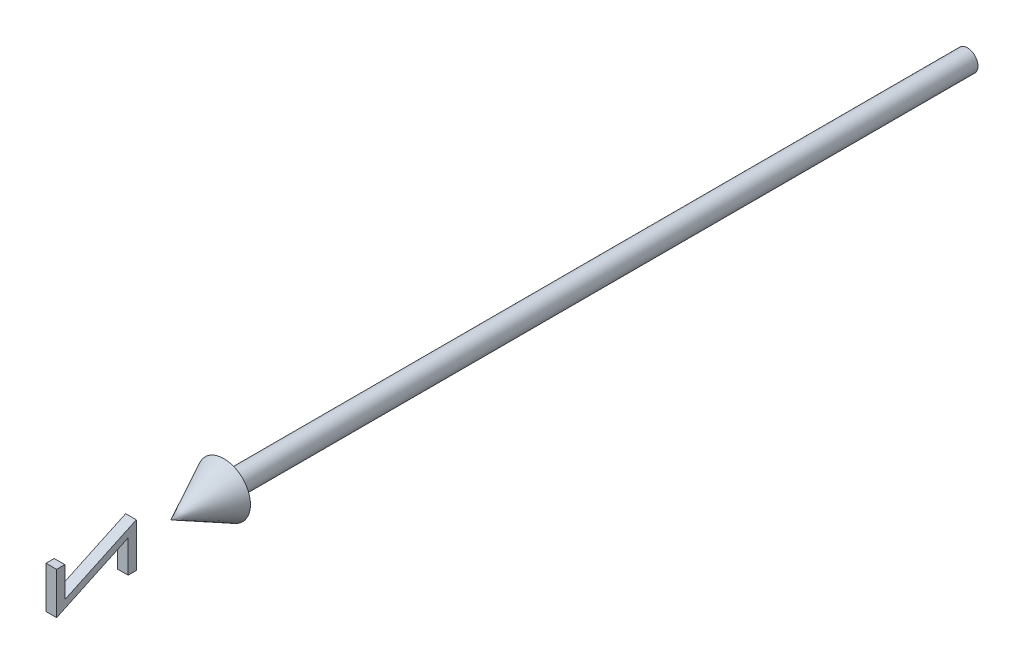
ISO-10303-21;
HEADER;
FILE_DESCRIPTION(('STEP AP214'),'2;1');
FILE_NAME('part.step','',(''),(''),'','','');
FILE_SCHEMA(('AUTOMOTIVE_DESIGN { 1 0 10303 214 1 1 1 1 }'));
ENDSEC;
DATA;
#1=APPLICATION_CONTEXT('core data for automotive mechanical design processes');
#2=APPLICATION_PROTOCOL_DEFINITION('international standard','automotive_design',2000,#1);
#3=PRODUCT_CONTEXT('',#1,'mechanical');
#4=PRODUCT('Part','Part','',(#3));
#5=PRODUCT_RELATED_PRODUCT_CATEGORY('part','',(#4));
#6=PRODUCT_DEFINITION_FORMATION('','',#4);
#7=PRODUCT_DEFINITION_CONTEXT('part definition',#1,'design');
#8=PRODUCT_DEFINITION('design','',#6,#7);
#9=PRODUCT_DEFINITION_SHAPE('','',#8);
#10=(LENGTH_UNIT() NAMED_UNIT(*) SI_UNIT(.MILLI.,.METRE.));
#11=(NAMED_UNIT(*) PLANE_ANGLE_UNIT() SI_UNIT($,.RADIAN.));
#12=(NAMED_UNIT(*) SI_UNIT($,.STERADIAN.) SOLID_ANGLE_UNIT());
#13=UNCERTAINTY_MEASURE_WITH_UNIT(LENGTH_MEASURE(1.E-05),#10,'distance_accuracy_value','');
#14=(GEOMETRIC_REPRESENTATION_CONTEXT(3) GLOBAL_UNCERTAINTY_ASSIGNED_CONTEXT((#13)) GLOBAL_UNIT_ASSIGNED_CONTEXT((#10,
#11,#12)) REPRESENTATION_CONTEXT('',''));
#15=CARTESIAN_POINT('',(0.,0.,0.));
#16=DIRECTION('',(0.,0.,1.));
#17=DIRECTION('',(1.,0.,0.));
#18=AXIS2_PLACEMENT_3D('',#15,#16,#17);
#19=CARTESIAN_POINT('',(1.00000000000009,-2.02042429202079,170.961538461538));
#20=DIRECTION('',(0.,0.,1.));
#21=DIRECTION('',(1.,0.,0.));
#22=AXIS2_PLACEMENT_3D('',#19,#20,#21);
#23=PLANE('',#22);
#24=DIRECTION('',(-1.,0.,0.));
#25=VECTOR('',#24,1.);
#26=CARTESIAN_POINT('',(1.00000000000009,-2.02042429202079,170.961538461538));
#27=LINE('',#26,#25);
#28=CARTESIAN_POINT('',(1.00000000000009,-2.02042429202079,170.961538461538));
#29=VERTEX_POINT('',#28);
#30=CARTESIAN_POINT('',(-0.999999999999906,-2.02042429202079,170.961538461538));
#31=VERTEX_POINT('',#30);
#32=EDGE_CURVE('E131',#29,#31,#27,.T.);
#33=ORIENTED_EDGE('',*,*,#32,.T.);
#34=DIRECTION('',(0.,1.,0.));
#35=VECTOR('',#34,1.);
#36=CARTESIAN_POINT('',(-0.999999999999906,-2.02042429202079,170.961538461538));
#37=LINE('',#36,#35);
#38=CARTESIAN_POINT('',(-0.999999999999906,3.69471993874844,170.961538461538));
#39=VERTEX_POINT('',#38);
#40=EDGE_CURVE('E125',#31,#39,#37,.T.);
#41=ORIENTED_EDGE('',*,*,#40,.T.);
#42=DIRECTION('',(-1.,0.,0.));
#43=VECTOR('',#42,1.);
#44=CARTESIAN_POINT('',(1.00000000000009,3.69471993874844,170.961538461538));
#45=LINE('',#44,#43);
#46=CARTESIAN_POINT('',(1.00000000000009,3.69471993874844,170.961538461538));
#47=VERTEX_POINT('',#46);
#48=EDGE_CURVE('E12',#47,#39,#45,.T.);
#49=ORIENTED_EDGE('',*,*,#48,.F.);
#50=DIRECTION('',(0.,1.,0.));
#51=VECTOR('',#50,1.);
#52=CARTESIAN_POINT('',(1.00000000000009,-2.02042429202079,170.961538461538));
#53=LINE('',#52,#51);
#54=EDGE_CURVE('E149',#29,#47,#53,.T.);
#55=ORIENTED_EDGE('',*,*,#54,.F.);
#56=EDGE_LOOP('',(#33,#41,#49,#55));
#57=FACE_BOUND('',#56,.T.);
#58=ADVANCED_FACE('F49',(#57),#23,.F.);
#59=CARTESIAN_POINT('',(1.00000000000009,3.69471993874844,170.961538461538));
#60=DIRECTION('',(0.,-1.,0.));
#61=DIRECTION('',(0.,0.,-1.));
#62=AXIS2_PLACEMENT_3D('',#59,#60,#61);
#63=PLANE('',#62);
#64=ORIENTED_EDGE('',*,*,#48,.T.);
#65=DIRECTION('',(0.,0.,1.));
#66=VECTOR('',#65,1.);
#67=CARTESIAN_POINT('',(-0.999999999999906,3.69471993874844,170.961538461538));
#68=LINE('',#67,#66);
#69=CARTESIAN_POINT('',(-0.999999999999895,3.69471993874844,172.5));
#70=VERTEX_POINT('',#69);
#71=EDGE_CURVE('E115',#39,#70,#68,.T.);
#72=ORIENTED_EDGE('',*,*,#71,.T.);
#73=DIRECTION('',(-1.,0.,0.));
#74=VECTOR('',#73,1.);
#75=CARTESIAN_POINT('',(1.0000000000001,3.69471993874844,172.5));
#76=LINE('',#75,#74);
#77=CARTESIAN_POINT('',(1.0000000000001,3.69471993874844,172.5));
#78=VERTEX_POINT('',#77);
#79=EDGE_CURVE('E56',#78,#70,#76,.T.);
#80=ORIENTED_EDGE('',*,*,#79,.F.);
#81=DIRECTION('',(0.,0.,1.));
#82=VECTOR('',#81,1.);
#83=CARTESIAN_POINT('',(1.00000000000009,3.69471993874844,170.961538461538));
#84=LINE('',#83,#82);
#85=EDGE_CURVE('E116',#47,#78,#84,.T.);
#86=ORIENTED_EDGE('',*,*,#85,.F.);
#87=EDGE_LOOP('',(#64,#72,#80,#86));
#88=FACE_BOUND('',#87,.T.);
#89=ADVANCED_FACE('F113',(#88),#63,.F.);
#90=CARTESIAN_POINT('',(1.0000000000001,3.69471993874844,172.5));
#91=DIRECTION('',(0.,0.,-1.));
#92=DIRECTION('',(-1.,0.,0.));
#93=AXIS2_PLACEMENT_3D('',#90,#91,#92);
#94=PLANE('',#93);
#95=ORIENTED_EDGE('',*,*,#79,.T.);
#96=DIRECTION('',(0.,-1.,0.));
#97=VECTOR('',#96,1.);
#98=CARTESIAN_POINT('',(-0.999999999999895,3.69471993874844,172.5));
#99=LINE('',#98,#97);
#100=CARTESIAN_POINT('',(-0.999999999999895,-4.18989544586694,172.5));
#101=VERTEX_POINT('',#100);
#102=EDGE_CURVE('E129',#70,#101,#99,.T.);
#103=ORIENTED_EDGE('',*,*,#102,.T.);
#104=DIRECTION('',(-1.,0.,0.));
#105=VECTOR('',#104,1.);
#106=CARTESIAN_POINT('',(1.0000000000001,-4.18989544586694,172.5));
#107=LINE('',#106,#105);
#108=CARTESIAN_POINT('',(1.0000000000001,-4.18989544586694,172.5));
#109=VERTEX_POINT('',#108);
#110=EDGE_CURVE('E171',#109,#101,#107,.T.);
#111=ORIENTED_EDGE('',*,*,#110,.F.);
#112=DIRECTION('',(0.,-1.,0.));
#113=VECTOR('',#112,1.);
#114=CARTESIAN_POINT('',(1.0000000000001,3.69471993874844,172.5));
#115=LINE('',#114,#113);
#116=EDGE_CURVE('E152',#78,#109,#115,.T.);
#117=ORIENTED_EDGE('',*,*,#116,.F.);
#118=EDGE_LOOP('',(#95,#103,#111,#117));
#119=FACE_BOUND('',#118,.T.);
#120=ADVANCED_FACE('F174',(#119),#94,.F.);
#121=CARTESIAN_POINT('',(1.0000000000001,-4.18989544586694,172.5));
#122=DIRECTION('',(0.,0.905924666699453,0.42343889555104));
#123=DIRECTION('',(0.,-0.42343889555104,0.905924666699453));
#124=AXIS2_PLACEMENT_3D('',#121,#122,#123);
#125=PLANE('',#124);
#126=ORIENTED_EDGE('',*,*,#110,.T.);
#127=DIRECTION('',(0.,0.42343889555104,-0.905924666699453));
#128=VECTOR('',#127,1.);
#129=CARTESIAN_POINT('',(-0.999999999999895,-4.18989544586694,172.5));
#130=LINE('',#129,#128);
#131=CARTESIAN_POINT('',(-0.999999999999989,2.10217186182537,159.038461538462));
#132=VERTEX_POINT('',#131);
#133=EDGE_CURVE('E135',#101,#132,#130,.T.);
#134=ORIENTED_EDGE('',*,*,#133,.T.);
#135=DIRECTION('',(-1.,0.,0.));
#136=VECTOR('',#135,1.);
#137=CARTESIAN_POINT('',(1.00000000000001,2.10217186182537,159.038461538462));
#138=LINE('',#137,#136);
#139=CARTESIAN_POINT('',(1.00000000000001,2.10217186182537,159.038461538462));
#140=VERTEX_POINT('',#139);
#141=EDGE_CURVE('E169',#140,#132,#138,.T.);
#142=ORIENTED_EDGE('',*,*,#141,.F.);
#143=DIRECTION('',(0.,0.42343889555104,-0.905924666699453));
#144=VECTOR('',#143,1.);
#145=CARTESIAN_POINT('',(1.0000000000001,-4.18989544586694,172.5));
#146=LINE('',#145,#144);
#147=EDGE_CURVE('E154',#109,#140,#146,.T.);
#148=ORIENTED_EDGE('',*,*,#147,.F.);
#149=EDGE_LOOP('',(#126,#134,#142,#148));
#150=FACE_BOUND('',#149,.T.);
#151=ADVANCED_FACE('F182',(#150),#125,.F.);
#152=CARTESIAN_POINT('',(1.00000000000001,2.10217186182537,159.038461538462));
#153=DIRECTION('',(0.,0.,-1.));
#154=DIRECTION('',(-1.,0.,0.));
#155=AXIS2_PLACEMENT_3D('',#152,#153,#154);
#156=PLANE('',#155);
#157=ORIENTED_EDGE('',*,*,#141,.T.);
#158=DIRECTION('',(0.,-1.,0.));
#159=VECTOR('',#158,1.);
#160=CARTESIAN_POINT('',(-0.999999999999989,2.10217186182537,159.038461538462));
#161=LINE('',#160,#159);
#162=CARTESIAN_POINT('',(-0.999999999999989,-3.99758775355925,159.038461538462));
#163=VERTEX_POINT('',#162);
#164=EDGE_CURVE('E138',#132,#163,#161,.T.);
#165=ORIENTED_EDGE('',*,*,#164,.T.);
#166=DIRECTION('',(-1.,0.,0.));
#167=VECTOR('',#166,1.);
#168=CARTESIAN_POINT('',(1.00000000000001,-3.99758775355925,159.038461538462));
#169=LINE('',#168,#167);
#170=CARTESIAN_POINT('',(1.00000000000001,-3.99758775355925,159.038461538462));
#171=VERTEX_POINT('',#170);
#172=EDGE_CURVE('E167',#171,#163,#169,.T.);
#173=ORIENTED_EDGE('',*,*,#172,.F.);
#174=DIRECTION('',(0.,-1.,0.));
#175=VECTOR('',#174,1.);
#176=CARTESIAN_POINT('',(1.00000000000001,2.10217186182537,159.038461538462));
#177=LINE('',#176,#175);
#178=EDGE_CURVE('E156',#140,#171,#177,.T.);
#179=ORIENTED_EDGE('',*,*,#178,.F.);
#180=EDGE_LOOP('',(#157,#165,#173,#179));
#181=FACE_BOUND('',#180,.T.);
#182=ADVANCED_FACE('F185',(#181),#156,.F.);
#183=CARTESIAN_POINT('',(1.00000000000001,-3.99758775355925,159.038461538462));
#184=DIRECTION('',(0.,1.,0.));
#185=DIRECTION('',(0.,0.,1.));
#186=AXIS2_PLACEMENT_3D('',#183,#184,#185);
#187=PLANE('',#186);
#188=ORIENTED_EDGE('',*,*,#172,.T.);
#189=DIRECTION('',(0.,0.,-1.));
#190=VECTOR('',#189,1.);
#191=CARTESIAN_POINT('',(-0.999999999999989,-3.99758775355925,159.038461538462));
#192=LINE('',#191,#190);
#193=CARTESIAN_POINT('',(-1.,-3.99758775355925,157.5));
#194=VERTEX_POINT('',#193);
#195=EDGE_CURVE('E141',#163,#194,#192,.T.);
#196=ORIENTED_EDGE('',*,*,#195,.T.);
#197=DIRECTION('',(-1.,0.,0.));
#198=VECTOR('',#197,1.);
#199=CARTESIAN_POINT('',(1.,-3.99758775355925,157.5));
#200=LINE('',#199,#198);
#201=CARTESIAN_POINT('',(1.,-3.99758775355925,157.5));
#202=VERTEX_POINT('',#201);
#203=EDGE_CURVE('E165',#202,#194,#200,.T.);
#204=ORIENTED_EDGE('',*,*,#203,.F.);
#205=DIRECTION('',(0.,0.,-1.));
#206=VECTOR('',#205,1.);
#207=CARTESIAN_POINT('',(1.00000000000001,-3.99758775355925,159.038461538462));
#208=LINE('',#207,#206);
#209=EDGE_CURVE('E158',#171,#202,#208,.T.);
#210=ORIENTED_EDGE('',*,*,#209,.F.);
#211=EDGE_LOOP('',(#188,#196,#204,#210));
#212=FACE_BOUND('',#211,.T.);
#213=ADVANCED_FACE('F190',(#212),#187,.F.);
#214=CARTESIAN_POINT('',(1.,-3.99758775355925,157.5));
#215=DIRECTION('',(0.,0.,1.));
#216=DIRECTION('',(1.,0.,0.));
#217=AXIS2_PLACEMENT_3D('',#214,#215,#216);
#218=PLANE('',#217);
#219=ORIENTED_EDGE('',*,*,#203,.T.);
#220=DIRECTION('',(0.,1.,0.));
#221=VECTOR('',#220,1.);
#222=CARTESIAN_POINT('',(-1.,-3.99758775355925,157.5));
#223=LINE('',#222,#221);
#224=CARTESIAN_POINT('',(-1.,4.27164301567152,157.5));
#225=VERTEX_POINT('',#224);
#226=EDGE_CURVE('E144',#194,#225,#223,.T.);
#227=ORIENTED_EDGE('',*,*,#226,.T.);
#228=DIRECTION('',(-1.,0.,0.));
#229=VECTOR('',#228,1.);
#230=CARTESIAN_POINT('',(1.,4.27164301567152,157.5));
#231=LINE('',#230,#229);
#232=CARTESIAN_POINT('',(1.,4.27164301567152,157.5));
#233=VERTEX_POINT('',#232);
#234=EDGE_CURVE('E163',#233,#225,#231,.T.);
#235=ORIENTED_EDGE('',*,*,#234,.F.);
#236=DIRECTION('',(0.,1.,0.));
#237=VECTOR('',#236,1.);
#238=CARTESIAN_POINT('',(1.,-3.99758775355925,157.5));
#239=LINE('',#238,#237);
#240=EDGE_CURVE('E68',#202,#233,#239,.T.);
#241=ORIENTED_EDGE('',*,*,#240,.F.);
#242=EDGE_LOOP('',(#219,#227,#235,#241));
#243=FACE_BOUND('',#242,.T.);
#244=ADVANCED_FACE('F193',(#243),#218,.F.);
#245=CARTESIAN_POINT('',(1.,4.27164301567152,157.5));
#246=DIRECTION('',(0.,-0.905924666699454,-0.423438895551039));
#247=DIRECTION('',(0.,0.423438895551039,-0.905924666699454));
#248=AXIS2_PLACEMENT_3D('',#245,#246,#247);
#249=PLANE('',#248);
#250=ORIENTED_EDGE('',*,*,#234,.T.);
#251=DIRECTION('',(0.,-0.423438895551039,0.905924666699454));
#252=VECTOR('',#251,1.);
#253=CARTESIAN_POINT('',(-1.,4.27164301567152,157.5));
#254=LINE('',#253,#252);
#255=EDGE_CURVE('E147',#225,#31,#254,.T.);
#256=ORIENTED_EDGE('',*,*,#255,.T.);
#257=ORIENTED_EDGE('',*,*,#32,.F.);
#258=DIRECTION('',(0.,-0.423438895551039,0.905924666699454));
#259=VECTOR('',#258,1.);
#260=CARTESIAN_POINT('',(1.,4.27164301567152,157.5));
#261=LINE('',#260,#259);
#262=EDGE_CURVE('E63',#233,#29,#261,.T.);
#263=ORIENTED_EDGE('',*,*,#262,.F.);
#264=EDGE_LOOP('',(#250,#256,#257,#263));
#265=FACE_BOUND('',#264,.T.);
#266=ADVANCED_FACE('F195',(#265),#249,.F.);
#267=CARTESIAN_POINT('',(0.9999999999989,0.,0.));
#268=DIRECTION('',(1.,0.,0.));
#269=DIRECTION('',(0.,0.,-1.));
#270=AXIS2_PLACEMENT_3D('',#267,#268,#269);
#271=PLANE('',#270);
#272=ORIENTED_EDGE('',*,*,#54,.T.);
#273=ORIENTED_EDGE('',*,*,#85,.T.);
#274=ORIENTED_EDGE('',*,*,#116,.T.);
#275=ORIENTED_EDGE('',*,*,#147,.T.);
#276=ORIENTED_EDGE('',*,*,#178,.T.);
#277=ORIENTED_EDGE('',*,*,#209,.T.);
#278=ORIENTED_EDGE('',*,*,#240,.T.);
#279=ORIENTED_EDGE('',*,*,#262,.T.);
#280=EDGE_LOOP('',(#272,#273,#274,#275,#276,#277,#278,#279));
#281=FACE_BOUND('',#280,.T.);
#282=ADVANCED_FACE('F177',(#281),#271,.T.);
#283=CARTESIAN_POINT('',(-1.0000000000011,0.,0.));
#284=DIRECTION('',(1.,0.,0.));
#285=DIRECTION('',(0.,0.,-1.));
#286=AXIS2_PLACEMENT_3D('',#283,#284,#285);
#287=PLANE('',#286);
#288=ORIENTED_EDGE('',*,*,#40,.F.);
#289=ORIENTED_EDGE('',*,*,#255,.F.);
#290=ORIENTED_EDGE('',*,*,#226,.F.);
#291=ORIENTED_EDGE('',*,*,#195,.F.);
#292=ORIENTED_EDGE('',*,*,#164,.F.);
#293=ORIENTED_EDGE('',*,*,#133,.F.);
#294=ORIENTED_EDGE('',*,*,#102,.F.);
#295=ORIENTED_EDGE('',*,*,#71,.F.);
#296=EDGE_LOOP('',(#288,#289,#290,#291,#292,#293,#294,#295));
#297=FACE_BOUND('',#296,.T.);
#298=ADVANCED_FACE('F123',(#297),#287,.F.);
#299=CLOSED_SHELL('',(#58,#89,#120,#151,#182,#213,#244,#266,#282,#298));
#300=MANIFOLD_SOLID_BREP('B2',#299);
#301=CARTESIAN_POINT('',(2.,0.,0.));
#302=DIRECTION('',(0.,0.,1.));
#303=DIRECTION('',(1.,0.,0.));
#304=AXIS2_PLACEMENT_3D('',#301,#302,#303);
#305=PLANE('',#304);
#306=CARTESIAN_POINT('',(0.,0.,0.));
#307=DIRECTION('',(0.,0.,-1.));
#308=DIRECTION('',(-1.,0.,0.));
#309=AXIS2_PLACEMENT_3D('',#306,#307,#308);
#310=CIRCLE('',#309,2.);
#311=CARTESIAN_POINT('',(-2.,0.,0.));
#312=VERTEX_POINT('',#311);
#313=EDGE_CURVE('E47',#312,#312,#310,.T.);
#314=ORIENTED_EDGE('',*,*,#313,.T.);
#315=EDGE_LOOP('',(#314));
#316=FACE_BOUND('',#315,.T.);
#317=ADVANCED_FACE('F277',(#316),#305,.F.);
#318=CARTESIAN_POINT('',(0.,0.,-41.9499520246458));
#319=DIRECTION('',(0.,0.,-1.));
#320=DIRECTION('',(-1.,0.,0.));
#321=AXIS2_PLACEMENT_3D('',#318,#319,#320);
#322=CYLINDRICAL_SURFACE('',#321,2.);
#323=ORIENTED_EDGE('',*,*,#313,.F.);
#324=EDGE_LOOP('',(#323));
#325=FACE_BOUND('',#324,.T.);
#326=CARTESIAN_POINT('',(0.,0.,140.));
#327=DIRECTION('',(0.,0.,-1.));
#328=DIRECTION('',(-1.,0.,0.));
#329=AXIS2_PLACEMENT_3D('',#326,#327,#328);
#330=CIRCLE('',#329,2.);
#331=CARTESIAN_POINT('',(-2.,0.,140.));
#332=VERTEX_POINT('',#331);
#333=EDGE_CURVE('E283',#332,#332,#330,.T.);
#334=ORIENTED_EDGE('',*,*,#333,.T.);
#335=EDGE_LOOP('',(#334));
#336=FACE_BOUND('',#335,.T.);
#337=ADVANCED_FACE('F294',(#325,#336),#322,.T.);
#338=CARTESIAN_POINT('',(5.00000000000002,0.,140.));
#339=DIRECTION('',(0.,0.,1.));
#340=DIRECTION('',(1.,0.,0.));
#341=AXIS2_PLACEMENT_3D('',#338,#339,#340);
#342=PLANE('',#341);
#343=ORIENTED_EDGE('',*,*,#333,.F.);
#344=EDGE_LOOP('',(#343));
#345=FACE_BOUND('',#344,.T.);
#346=CARTESIAN_POINT('',(0.,0.,140.));
#347=DIRECTION('',(0.,0.,-1.));
#348=DIRECTION('',(-1.,0.,0.));
#349=AXIS2_PLACEMENT_3D('',#346,#347,#348);
#350=CIRCLE('',#349,5.00000000000002);
#351=CARTESIAN_POINT('',(-5.00000000000002,0.,140.));
#352=VERTEX_POINT('',#351);
#353=EDGE_CURVE('E308',#352,#352,#350,.T.);
#354=ORIENTED_EDGE('',*,*,#353,.T.);
#355=EDGE_LOOP('',(#354));
#356=FACE_BOUND('',#355,.T.);
#357=ADVANCED_FACE('F288',(#345,#356),#342,.F.);
#358=CARTESIAN_POINT('',(0.,0.,150.));
#359=DIRECTION('',(0.,0.,-1.));
#360=DIRECTION('',(-1.,0.,0.));
#361=AXIS2_PLACEMENT_3D('',#358,#359,#360);
#362=CONICAL_SURFACE('',#361,0.,0.463647609000806);
#363=ORIENTED_EDGE('',*,*,#353,.F.);
#364=EDGE_LOOP('',(#363));
#365=FACE_BOUND('',#364,.T.);
#366=CARTESIAN_POINT('',(0.,0.,150.));
#367=VERTEX_POINT('',#366);
#368=VERTEX_LOOP('',#367);
#369=FACE_BOUND('',#368,.T.);
#370=ADVANCED_FACE('F286',(#365,#369),#362,.T.);
#371=CLOSED_SHELL('',(#317,#337,#357,#370));
#372=MANIFOLD_SOLID_BREP('B6',#371);
#373=ADVANCED_BREP_SHAPE_REPRESENTATION('',(#18,#300,#372),#14);
#374=SHAPE_DEFINITION_REPRESENTATION(#9,#373);
ENDSEC;
END-ISO-10303-21;
